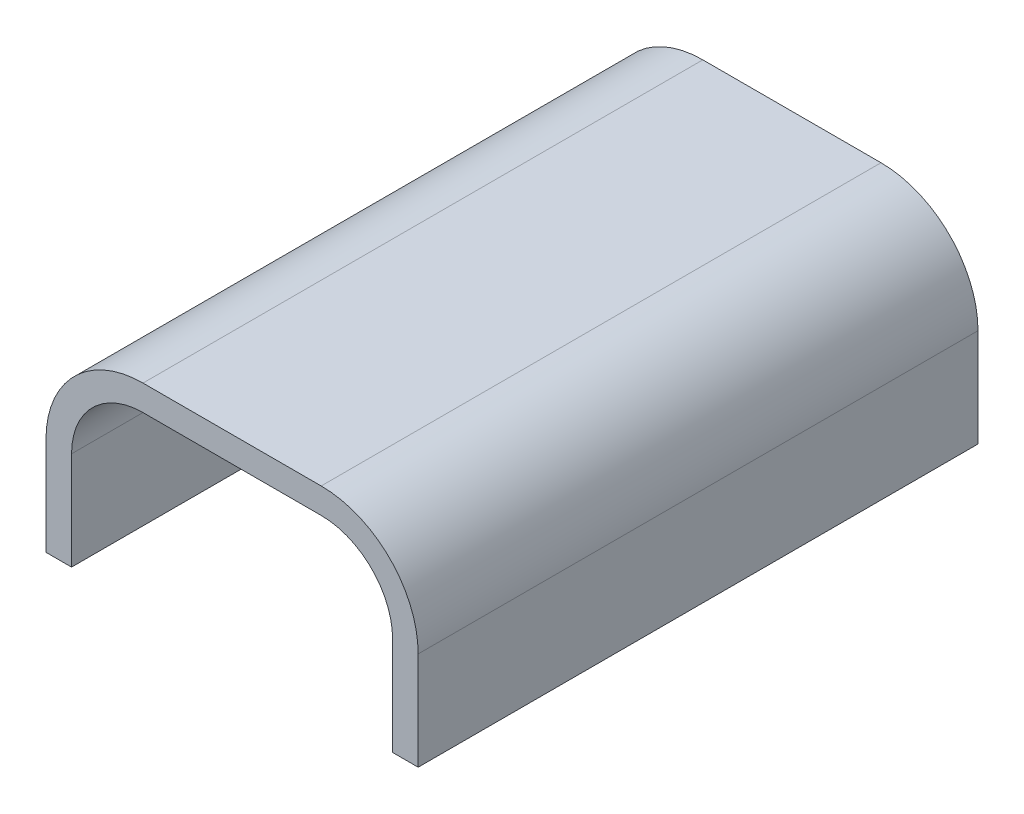
ISO-10303-21;
HEADER;
FILE_DESCRIPTION(('STEP AP214'),'2;1');
FILE_NAME('part.step','',(''),(''),'','','');
FILE_SCHEMA(('AUTOMOTIVE_DESIGN { 1 0 10303 214 1 1 1 1 }'));
ENDSEC;
DATA;
#1=APPLICATION_CONTEXT('core data for automotive mechanical design processes');
#2=APPLICATION_PROTOCOL_DEFINITION('international standard','automotive_design',2000,#1);
#3=PRODUCT_CONTEXT('',#1,'mechanical');
#4=PRODUCT('Part','Part','',(#3));
#5=PRODUCT_RELATED_PRODUCT_CATEGORY('part','',(#4));
#6=PRODUCT_DEFINITION_FORMATION('','',#4);
#7=PRODUCT_DEFINITION_CONTEXT('part definition',#1,'design');
#8=PRODUCT_DEFINITION('design','',#6,#7);
#9=PRODUCT_DEFINITION_SHAPE('','',#8);
#10=(LENGTH_UNIT() NAMED_UNIT(*) SI_UNIT(.MILLI.,.METRE.));
#11=(NAMED_UNIT(*) PLANE_ANGLE_UNIT() SI_UNIT($,.RADIAN.));
#12=(NAMED_UNIT(*) SI_UNIT($,.STERADIAN.) SOLID_ANGLE_UNIT());
#13=UNCERTAINTY_MEASURE_WITH_UNIT(LENGTH_MEASURE(1.E-05),#10,'distance_accuracy_value','');
#14=(GEOMETRIC_REPRESENTATION_CONTEXT(3) GLOBAL_UNCERTAINTY_ASSIGNED_CONTEXT((#13)) GLOBAL_UNIT_ASSIGNED_CONTEXT((#10,
#11,#12)) REPRESENTATION_CONTEXT('',''));
#15=CARTESIAN_POINT('',(0.,0.,0.));
#16=DIRECTION('',(0.,0.,1.));
#17=DIRECTION('',(1.,0.,0.));
#18=AXIS2_PLACEMENT_3D('',#15,#16,#17);
#19=CARTESIAN_POINT('',(-11.8,0.,0.));
#20=DIRECTION('',(0.,-1.,0.));
#21=DIRECTION('',(0.,0.,-1.));
#22=AXIS2_PLACEMENT_3D('',#19,#20,#21);
#23=PLANE('',#22);
#24=DIRECTION('',(0.,0.,1.));
#25=VECTOR('',#24,1.);
#26=CARTESIAN_POINT('',(-11.8,0.,0.));
#27=LINE('',#26,#25);
#28=CARTESIAN_POINT('',(-11.8,0.,0.));
#29=VERTEX_POINT('',#28);
#30=CARTESIAN_POINT('',(-11.8,0.,35.5));
#31=VERTEX_POINT('',#30);
#32=EDGE_CURVE('E186',#29,#31,#27,.T.);
#33=ORIENTED_EDGE('',*,*,#32,.F.);
#34=DIRECTION('',(1.,0.,0.));
#35=VECTOR('',#34,1.);
#36=CARTESIAN_POINT('',(-11.8,0.,0.));
#37=LINE('',#36,#35);
#38=CARTESIAN_POINT('',(-10.18,0.,0.));
#39=VERTEX_POINT('',#38);
#40=EDGE_CURVE('E105',#29,#39,#37,.T.);
#41=ORIENTED_EDGE('',*,*,#40,.T.);
#42=DIRECTION('',(0.,0.,-1.));
#43=VECTOR('',#42,1.);
#44=CARTESIAN_POINT('',(-10.18,0.,0.));
#45=LINE('',#44,#43);
#46=CARTESIAN_POINT('',(-10.18,0.,35.5));
#47=VERTEX_POINT('',#46);
#48=EDGE_CURVE('E173',#47,#39,#45,.T.);
#49=ORIENTED_EDGE('',*,*,#48,.F.);
#50=DIRECTION('',(1.,0.,0.));
#51=VECTOR('',#50,1.);
#52=CARTESIAN_POINT('',(-11.8,0.,35.5));
#53=LINE('',#52,#51);
#54=EDGE_CURVE('E197',#47,#31,#53,.F.);
#55=ORIENTED_EDGE('',*,*,#54,.T.);
#56=EDGE_LOOP('',(#33,#41,#49,#55));
#57=FACE_BOUND('',#56,.T.);
#58=ADVANCED_FACE('F16',(#57),#23,.T.);
#59=CARTESIAN_POINT('',(10.18,0.,0.));
#60=DIRECTION('',(0.,-1.,0.));
#61=DIRECTION('',(1.,0.,0.));
#62=AXIS2_PLACEMENT_3D('',#59,#60,#61);
#63=PLANE('',#62);
#64=DIRECTION('',(0.,0.,1.));
#65=VECTOR('',#64,1.);
#66=CARTESIAN_POINT('',(10.18,0.,0.));
#67=LINE('',#66,#65);
#68=CARTESIAN_POINT('',(10.18,0.,0.));
#69=VERTEX_POINT('',#68);
#70=CARTESIAN_POINT('',(10.18,0.,35.5));
#71=VERTEX_POINT('',#70);
#72=EDGE_CURVE('E140',#69,#71,#67,.T.);
#73=ORIENTED_EDGE('',*,*,#72,.F.);
#74=DIRECTION('',(1.,0.,0.));
#75=VECTOR('',#74,1.);
#76=CARTESIAN_POINT('',(10.18,0.,0.));
#77=LINE('',#76,#75);
#78=CARTESIAN_POINT('',(11.8,0.,0.));
#79=VERTEX_POINT('',#78);
#80=EDGE_CURVE('E125',#69,#79,#77,.T.);
#81=ORIENTED_EDGE('',*,*,#80,.T.);
#82=DIRECTION('',(0.,0.,1.));
#83=VECTOR('',#82,1.);
#84=CARTESIAN_POINT('',(11.8,0.,0.));
#85=LINE('',#84,#83);
#86=CARTESIAN_POINT('',(11.8,0.,35.5));
#87=VERTEX_POINT('',#86);
#88=EDGE_CURVE('E168',#87,#79,#85,.F.);
#89=ORIENTED_EDGE('',*,*,#88,.F.);
#90=DIRECTION('',(1.,0.,0.));
#91=VECTOR('',#90,1.);
#92=CARTESIAN_POINT('',(10.18,0.,35.5));
#93=LINE('',#92,#91);
#94=EDGE_CURVE('E129',#87,#71,#93,.F.);
#95=ORIENTED_EDGE('',*,*,#94,.T.);
#96=EDGE_LOOP('',(#73,#81,#89,#95));
#97=FACE_BOUND('',#96,.T.);
#98=ADVANCED_FACE('F293',(#97),#63,.T.);
#99=CARTESIAN_POINT('',(-5.65,6.2225,0.));
#100=DIRECTION('',(0.,0.,1.));
#101=DIRECTION('',(1.,0.,0.));
#102=AXIS2_PLACEMENT_3D('',#99,#100,#101);
#103=CYLINDRICAL_SURFACE('',#102,6.15);
#104=DIRECTION('',(0.,0.,1.));
#105=VECTOR('',#104,1.);
#106=CARTESIAN_POINT('',(-5.65,12.3725,0.));
#107=LINE('',#106,#105);
#108=CARTESIAN_POINT('',(-5.65,12.3725,0.));
#109=VERTEX_POINT('',#108);
#110=CARTESIAN_POINT('',(-5.65,12.3725,35.5));
#111=VERTEX_POINT('',#110);
#112=EDGE_CURVE('E164',#109,#111,#107,.T.);
#113=ORIENTED_EDGE('',*,*,#112,.F.);
#114=CARTESIAN_POINT('',(-5.65,6.2225,0.));
#115=DIRECTION('',(0.,0.,1.));
#116=DIRECTION('',(1.,0.,0.));
#117=AXIS2_PLACEMENT_3D('',#114,#115,#116);
#118=CIRCLE('',#117,6.15);
#119=CARTESIAN_POINT('',(-11.8,6.2225,0.));
#120=VERTEX_POINT('',#119);
#121=EDGE_CURVE('E210',#109,#120,#118,.T.);
#122=ORIENTED_EDGE('',*,*,#121,.T.);
#123=DIRECTION('',(0.,0.,1.));
#124=VECTOR('',#123,1.);
#125=CARTESIAN_POINT('',(-11.8,6.2225,0.));
#126=LINE('',#125,#124);
#127=CARTESIAN_POINT('',(-11.8,6.2225,35.5));
#128=VERTEX_POINT('',#127);
#129=EDGE_CURVE('E181',#128,#120,#126,.F.);
#130=ORIENTED_EDGE('',*,*,#129,.F.);
#131=CARTESIAN_POINT('',(-5.65,6.2225,35.5));
#132=DIRECTION('',(0.,0.,1.));
#133=DIRECTION('',(1.,0.,0.));
#134=AXIS2_PLACEMENT_3D('',#131,#132,#133);
#135=CIRCLE('',#134,6.15);
#136=EDGE_CURVE('E179',#111,#128,#135,.T.);
#137=ORIENTED_EDGE('',*,*,#136,.F.);
#138=EDGE_LOOP('',(#113,#122,#130,#137));
#139=FACE_BOUND('',#138,.T.);
#140=ADVANCED_FACE('F255',(#139),#103,.T.);
#141=CARTESIAN_POINT('',(-11.8,6.2225,0.));
#142=DIRECTION('',(-1.,0.,0.));
#143=DIRECTION('',(0.,0.,1.));
#144=AXIS2_PLACEMENT_3D('',#141,#142,#143);
#145=PLANE('',#144);
#146=ORIENTED_EDGE('',*,*,#129,.T.);
#147=DIRECTION('',(0.,1.,0.));
#148=VECTOR('',#147,1.);
#149=CARTESIAN_POINT('',(-11.8,0.,0.));
#150=LINE('',#149,#148);
#151=EDGE_CURVE('E212',#120,#29,#150,.F.);
#152=ORIENTED_EDGE('',*,*,#151,.T.);
#153=ORIENTED_EDGE('',*,*,#32,.T.);
#154=DIRECTION('',(0.,1.,0.));
#155=VECTOR('',#154,1.);
#156=CARTESIAN_POINT('',(-11.8,0.,35.5));
#157=LINE('',#156,#155);
#158=EDGE_CURVE('E134',#128,#31,#157,.F.);
#159=ORIENTED_EDGE('',*,*,#158,.F.);
#160=EDGE_LOOP('',(#146,#152,#153,#159));
#161=FACE_BOUND('',#160,.T.);
#162=ADVANCED_FACE('F258',(#161),#145,.T.);
#163=CARTESIAN_POINT('',(-10.18,0.,0.));
#164=DIRECTION('',(1.,0.,0.));
#165=DIRECTION('',(0.,0.,-1.));
#166=AXIS2_PLACEMENT_3D('',#163,#164,#165);
#167=PLANE('',#166);
#168=ORIENTED_EDGE('',*,*,#48,.T.);
#169=DIRECTION('',(0.,1.,0.));
#170=VECTOR('',#169,1.);
#171=CARTESIAN_POINT('',(-10.18,0.,0.));
#172=LINE('',#171,#170);
#173=CARTESIAN_POINT('',(-10.18,6.2225,0.));
#174=VERTEX_POINT('',#173);
#175=EDGE_CURVE('E98',#39,#174,#172,.T.);
#176=ORIENTED_EDGE('',*,*,#175,.T.);
#177=DIRECTION('',(0.,0.,1.));
#178=VECTOR('',#177,1.);
#179=CARTESIAN_POINT('',(-10.18,6.2225,0.));
#180=LINE('',#179,#178);
#181=CARTESIAN_POINT('',(-10.18,6.2225,35.5));
#182=VERTEX_POINT('',#181);
#183=EDGE_CURVE('E176',#174,#182,#180,.T.);
#184=ORIENTED_EDGE('',*,*,#183,.T.);
#185=DIRECTION('',(0.,1.,0.));
#186=VECTOR('',#185,1.);
#187=CARTESIAN_POINT('',(-10.18,0.,35.5));
#188=LINE('',#187,#186);
#189=EDGE_CURVE('E148',#47,#182,#188,.T.);
#190=ORIENTED_EDGE('',*,*,#189,.F.);
#191=EDGE_LOOP('',(#168,#176,#184,#190));
#192=FACE_BOUND('',#191,.T.);
#193=ADVANCED_FACE('F259',(#192),#167,.T.);
#194=CARTESIAN_POINT('',(10.18,6.2225,0.));
#195=DIRECTION('',(-1.,0.,0.));
#196=DIRECTION('',(0.,0.,1.));
#197=AXIS2_PLACEMENT_3D('',#194,#195,#196);
#198=PLANE('',#197);
#199=DIRECTION('',(0.,0.,1.));
#200=VECTOR('',#199,1.);
#201=CARTESIAN_POINT('',(10.18,6.2225,0.));
#202=LINE('',#201,#200);
#203=CARTESIAN_POINT('',(10.18,6.2225,35.5));
#204=VERTEX_POINT('',#203);
#205=CARTESIAN_POINT('',(10.18,6.2225,0.));
#206=VERTEX_POINT('',#205);
#207=EDGE_CURVE('E89',#204,#206,#202,.F.);
#208=ORIENTED_EDGE('',*,*,#207,.T.);
#209=DIRECTION('',(0.,1.,0.));
#210=VECTOR('',#209,1.);
#211=CARTESIAN_POINT('',(10.18,0.,0.));
#212=LINE('',#211,#210);
#213=EDGE_CURVE('E208',#206,#69,#212,.F.);
#214=ORIENTED_EDGE('',*,*,#213,.T.);
#215=ORIENTED_EDGE('',*,*,#72,.T.);
#216=DIRECTION('',(0.,1.,0.));
#217=VECTOR('',#216,1.);
#218=CARTESIAN_POINT('',(10.18,0.,35.5));
#219=LINE('',#218,#217);
#220=EDGE_CURVE('E138',#204,#71,#219,.F.);
#221=ORIENTED_EDGE('',*,*,#220,.F.);
#222=EDGE_LOOP('',(#208,#214,#215,#221));
#223=FACE_BOUND('',#222,.T.);
#224=ADVANCED_FACE('F139',(#223),#198,.T.);
#225=CARTESIAN_POINT('',(11.8,0.,0.));
#226=DIRECTION('',(1.,0.,0.));
#227=DIRECTION('',(0.,1.,0.));
#228=AXIS2_PLACEMENT_3D('',#225,#226,#227);
#229=PLANE('',#228);
#230=ORIENTED_EDGE('',*,*,#88,.T.);
#231=DIRECTION('',(0.,1.,0.));
#232=VECTOR('',#231,1.);
#233=CARTESIAN_POINT('',(11.8,0.,0.));
#234=LINE('',#233,#232);
#235=CARTESIAN_POINT('',(11.8,6.2225,0.));
#236=VERTEX_POINT('',#235);
#237=EDGE_CURVE('E118',#79,#236,#234,.T.);
#238=ORIENTED_EDGE('',*,*,#237,.T.);
#239=DIRECTION('',(0.,0.,1.));
#240=VECTOR('',#239,1.);
#241=CARTESIAN_POINT('',(11.8,6.2225,0.));
#242=LINE('',#241,#240);
#243=CARTESIAN_POINT('',(11.8,6.2225,35.5));
#244=VERTEX_POINT('',#243);
#245=EDGE_CURVE('E166',#244,#236,#242,.F.);
#246=ORIENTED_EDGE('',*,*,#245,.F.);
#247=DIRECTION('',(0.,1.,0.));
#248=VECTOR('',#247,1.);
#249=CARTESIAN_POINT('',(11.8,0.,35.5));
#250=LINE('',#249,#248);
#251=EDGE_CURVE('E142',#87,#244,#250,.T.);
#252=ORIENTED_EDGE('',*,*,#251,.F.);
#253=EDGE_LOOP('',(#230,#238,#246,#252));
#254=FACE_BOUND('',#253,.T.);
#255=ADVANCED_FACE('F282',(#254),#229,.T.);
#256=CARTESIAN_POINT('',(5.65,6.2225,0.));
#257=DIRECTION('',(0.,0.,1.));
#258=DIRECTION('',(1.,0.,0.));
#259=AXIS2_PLACEMENT_3D('',#256,#257,#258);
#260=CYLINDRICAL_SURFACE('',#259,6.15);
#261=ORIENTED_EDGE('',*,*,#245,.T.);
#262=CARTESIAN_POINT('',(5.65,6.2225,0.));
#263=DIRECTION('',(0.,0.,1.));
#264=DIRECTION('',(1.,0.,0.));
#265=AXIS2_PLACEMENT_3D('',#262,#263,#264);
#266=CIRCLE('',#265,6.15);
#267=CARTESIAN_POINT('',(5.65,12.3725,0.));
#268=VERTEX_POINT('',#267);
#269=EDGE_CURVE('E204',#236,#268,#266,.T.);
#270=ORIENTED_EDGE('',*,*,#269,.T.);
#271=DIRECTION('',(0.,0.,1.));
#272=VECTOR('',#271,1.);
#273=CARTESIAN_POINT('',(5.65,12.3725,0.));
#274=LINE('',#273,#272);
#275=CARTESIAN_POINT('',(5.65,12.3725,35.5));
#276=VERTEX_POINT('',#275);
#277=EDGE_CURVE('E135',#276,#268,#274,.F.);
#278=ORIENTED_EDGE('',*,*,#277,.F.);
#279=CARTESIAN_POINT('',(5.65,6.2225,35.5));
#280=DIRECTION('',(0.,0.,1.));
#281=DIRECTION('',(1.,0.,0.));
#282=AXIS2_PLACEMENT_3D('',#279,#280,#281);
#283=CIRCLE('',#282,6.15);
#284=EDGE_CURVE('E216',#244,#276,#283,.T.);
#285=ORIENTED_EDGE('',*,*,#284,.F.);
#286=EDGE_LOOP('',(#261,#270,#278,#285));
#287=FACE_BOUND('',#286,.T.);
#288=ADVANCED_FACE('F279',(#287),#260,.T.);
#289=CARTESIAN_POINT('',(5.65,12.3725,0.));
#290=DIRECTION('',(0.,1.,0.));
#291=DIRECTION('',(0.,0.,1.));
#292=AXIS2_PLACEMENT_3D('',#289,#290,#291);
#293=PLANE('',#292);
#294=ORIENTED_EDGE('',*,*,#277,.T.);
#295=DIRECTION('',(1.,0.,0.));
#296=VECTOR('',#295,1.);
#297=CARTESIAN_POINT('',(0.,12.3725,0.));
#298=LINE('',#297,#296);
#299=EDGE_CURVE('E206',#268,#109,#298,.F.);
#300=ORIENTED_EDGE('',*,*,#299,.T.);
#301=ORIENTED_EDGE('',*,*,#112,.T.);
#302=DIRECTION('',(1.,0.,0.));
#303=VECTOR('',#302,1.);
#304=CARTESIAN_POINT('',(0.,12.3725,35.5));
#305=LINE('',#304,#303);
#306=EDGE_CURVE('E215',#276,#111,#305,.F.);
#307=ORIENTED_EDGE('',*,*,#306,.F.);
#308=EDGE_LOOP('',(#294,#300,#301,#307));
#309=FACE_BOUND('',#308,.T.);
#310=ADVANCED_FACE('F247',(#309),#293,.T.);
#311=CARTESIAN_POINT('',(5.65,6.2225,0.));
#312=DIRECTION('',(0.,0.,1.));
#313=DIRECTION('',(1.,0.,0.));
#314=AXIS2_PLACEMENT_3D('',#311,#312,#313);
#315=CYLINDRICAL_SURFACE('',#314,4.53);
#316=CARTESIAN_POINT('',(5.65,6.2225,35.5));
#317=DIRECTION('',(0.,0.,1.));
#318=DIRECTION('',(1.,0.,0.));
#319=AXIS2_PLACEMENT_3D('',#316,#317,#318);
#320=CIRCLE('',#319,4.53);
#321=CARTESIAN_POINT('',(5.65,10.7525,35.5));
#322=VERTEX_POINT('',#321);
#323=EDGE_CURVE('E19',#322,#204,#320,.F.);
#324=ORIENTED_EDGE('',*,*,#323,.F.);
#325=DIRECTION('',(0.,0.,-1.));
#326=VECTOR('',#325,1.);
#327=CARTESIAN_POINT('',(5.65,10.7525,0.));
#328=LINE('',#327,#326);
#329=CARTESIAN_POINT('',(5.65,10.7525,0.));
#330=VERTEX_POINT('',#329);
#331=EDGE_CURVE('E77',#330,#322,#328,.F.);
#332=ORIENTED_EDGE('',*,*,#331,.F.);
#333=CARTESIAN_POINT('',(5.65,6.2225,0.));
#334=DIRECTION('',(0.,0.,1.));
#335=DIRECTION('',(1.,0.,0.));
#336=AXIS2_PLACEMENT_3D('',#333,#334,#335);
#337=CIRCLE('',#336,4.53);
#338=EDGE_CURVE('E132',#330,#206,#337,.F.);
#339=ORIENTED_EDGE('',*,*,#338,.T.);
#340=ORIENTED_EDGE('',*,*,#207,.F.);
#341=EDGE_LOOP('',(#324,#332,#339,#340));
#342=FACE_BOUND('',#341,.T.);
#343=ADVANCED_FACE('F131',(#342),#315,.F.);
#344=CARTESIAN_POINT('',(0.,0.,35.5));
#345=DIRECTION('',(0.,0.,1.));
#346=DIRECTION('',(1.,0.,0.));
#347=AXIS2_PLACEMENT_3D('',#344,#345,#346);
#348=PLANE('',#347);
#349=ORIENTED_EDGE('',*,*,#306,.T.);
#350=ORIENTED_EDGE('',*,*,#136,.T.);
#351=ORIENTED_EDGE('',*,*,#158,.T.);
#352=ORIENTED_EDGE('',*,*,#54,.F.);
#353=ORIENTED_EDGE('',*,*,#189,.T.);
#354=CARTESIAN_POINT('',(-5.65,6.2225,35.5));
#355=DIRECTION('',(0.,0.,1.));
#356=DIRECTION('',(1.,0.,0.));
#357=AXIS2_PLACEMENT_3D('',#354,#355,#356);
#358=CIRCLE('',#357,4.53);
#359=CARTESIAN_POINT('',(-5.65,10.7525,35.5));
#360=VERTEX_POINT('',#359);
#361=EDGE_CURVE('E178',#182,#360,#358,.F.);
#362=ORIENTED_EDGE('',*,*,#361,.T.);
#363=DIRECTION('',(1.,0.,0.));
#364=VECTOR('',#363,1.);
#365=CARTESIAN_POINT('',(-5.65,10.7525,35.5));
#366=LINE('',#365,#364);
#367=EDGE_CURVE('E147',#322,#360,#366,.F.);
#368=ORIENTED_EDGE('',*,*,#367,.F.);
#369=ORIENTED_EDGE('',*,*,#323,.T.);
#370=ORIENTED_EDGE('',*,*,#220,.T.);
#371=ORIENTED_EDGE('',*,*,#94,.F.);
#372=ORIENTED_EDGE('',*,*,#251,.T.);
#373=ORIENTED_EDGE('',*,*,#284,.T.);
#374=EDGE_LOOP('',(#349,#350,#351,#352,#353,#362,#368,#369,#370,#371,#372,#373));
#375=FACE_BOUND('',#374,.T.);
#376=ADVANCED_FACE('F145',(#375),#348,.T.);
#377=CARTESIAN_POINT('',(-5.65,6.2225,0.));
#378=DIRECTION('',(0.,0.,1.));
#379=DIRECTION('',(1.,0.,0.));
#380=AXIS2_PLACEMENT_3D('',#377,#378,#379);
#381=CYLINDRICAL_SURFACE('',#380,4.53);
#382=ORIENTED_EDGE('',*,*,#361,.F.);
#383=ORIENTED_EDGE('',*,*,#183,.F.);
#384=CARTESIAN_POINT('',(-5.65,6.2225,0.));
#385=DIRECTION('',(0.,0.,1.));
#386=DIRECTION('',(1.,0.,0.));
#387=AXIS2_PLACEMENT_3D('',#384,#385,#386);
#388=CIRCLE('',#387,4.53);
#389=CARTESIAN_POINT('',(-5.65,10.7525,0.));
#390=VERTEX_POINT('',#389);
#391=EDGE_CURVE('E34',#174,#390,#388,.F.);
#392=ORIENTED_EDGE('',*,*,#391,.T.);
#393=DIRECTION('',(0.,0.,-1.));
#394=VECTOR('',#393,1.);
#395=CARTESIAN_POINT('',(-5.65,10.7525,0.));
#396=LINE('',#395,#394);
#397=EDGE_CURVE('E25',#360,#390,#396,.T.);
#398=ORIENTED_EDGE('',*,*,#397,.F.);
#399=EDGE_LOOP('',(#382,#383,#392,#398));
#400=FACE_BOUND('',#399,.T.);
#401=ADVANCED_FACE('F260',(#400),#381,.F.);
#402=CARTESIAN_POINT('',(0.,0.,0.));
#403=DIRECTION('',(0.,0.,1.));
#404=DIRECTION('',(1.,0.,0.));
#405=AXIS2_PLACEMENT_3D('',#402,#403,#404);
#406=PLANE('',#405);
#407=ORIENTED_EDGE('',*,*,#269,.F.);
#408=ORIENTED_EDGE('',*,*,#237,.F.);
#409=ORIENTED_EDGE('',*,*,#80,.F.);
#410=ORIENTED_EDGE('',*,*,#213,.F.);
#411=ORIENTED_EDGE('',*,*,#338,.F.);
#412=DIRECTION('',(1.,0.,0.));
#413=VECTOR('',#412,1.);
#414=CARTESIAN_POINT('',(-5.65,10.7525,0.));
#415=LINE('',#414,#413);
#416=EDGE_CURVE('E10',#390,#330,#415,.T.);
#417=ORIENTED_EDGE('',*,*,#416,.F.);
#418=ORIENTED_EDGE('',*,*,#391,.F.);
#419=ORIENTED_EDGE('',*,*,#175,.F.);
#420=ORIENTED_EDGE('',*,*,#40,.F.);
#421=ORIENTED_EDGE('',*,*,#151,.F.);
#422=ORIENTED_EDGE('',*,*,#121,.F.);
#423=ORIENTED_EDGE('',*,*,#299,.F.);
#424=EDGE_LOOP('',(#407,#408,#409,#410,#411,#417,#418,#419,#420,#421,#422,#423));
#425=FACE_BOUND('',#424,.T.);
#426=ADVANCED_FACE('F253',(#425),#406,.F.);
#427=CARTESIAN_POINT('',(-5.65,10.7525,0.));
#428=DIRECTION('',(0.,-1.,0.));
#429=DIRECTION('',(0.,0.,-1.));
#430=AXIS2_PLACEMENT_3D('',#427,#428,#429);
#431=PLANE('',#430);
#432=ORIENTED_EDGE('',*,*,#397,.T.);
#433=ORIENTED_EDGE('',*,*,#416,.T.);
#434=ORIENTED_EDGE('',*,*,#331,.T.);
#435=ORIENTED_EDGE('',*,*,#367,.T.);
#436=EDGE_LOOP('',(#432,#433,#434,#435));
#437=FACE_BOUND('',#436,.T.);
#438=ADVANCED_FACE('F262',(#437),#431,.T.);
#439=CLOSED_SHELL('',(#58,#98,#140,#162,#193,#224,#255,#288,#310,#343,#376,#401,#426,#438));
#440=MANIFOLD_SOLID_BREP('B1',#439);
#441=ADVANCED_BREP_SHAPE_REPRESENTATION('',(#18,#440),#14);
#442=SHAPE_DEFINITION_REPRESENTATION(#9,#441);
ENDSEC;
END-ISO-10303-21;
